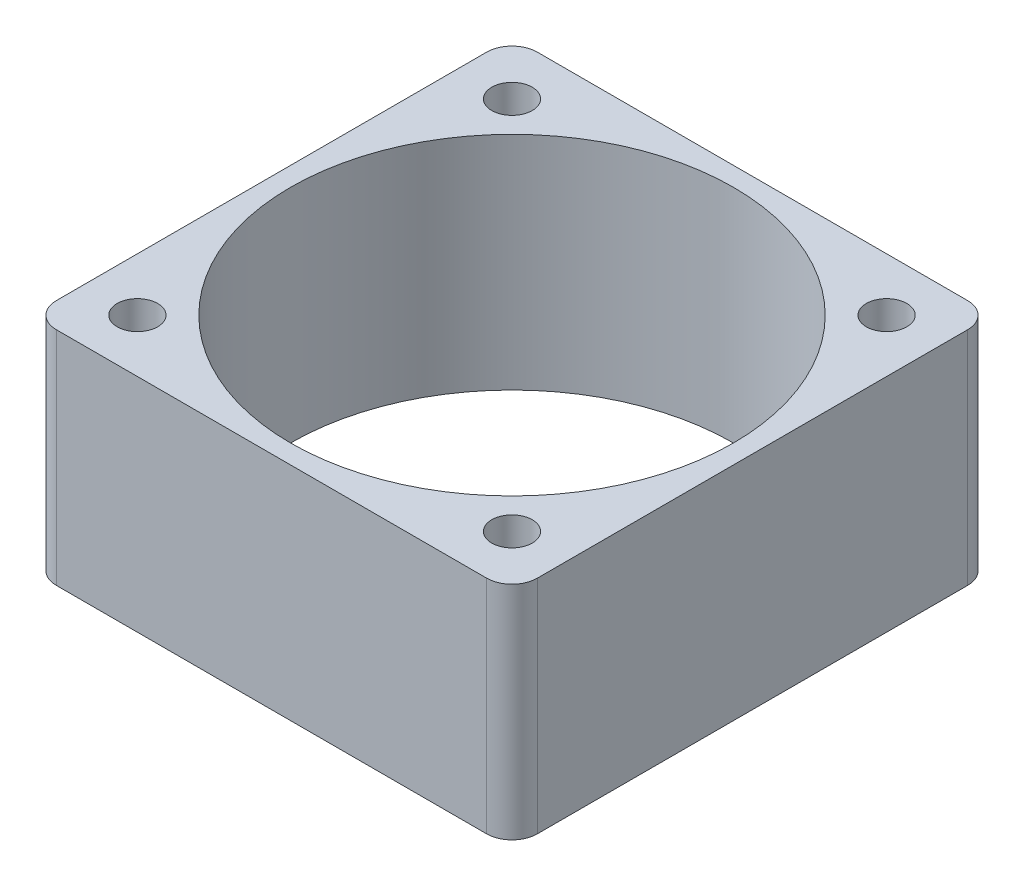
ISO-10303-21;
HEADER;
FILE_DESCRIPTION(('STEP AP214'),'2;1');
FILE_NAME('part.step','',(''),(''),'','','');
FILE_SCHEMA(('AUTOMOTIVE_DESIGN { 1 0 10303 214 1 1 1 1 }'));
ENDSEC;
DATA;
#1=APPLICATION_CONTEXT('core data for automotive mechanical design processes');
#2=APPLICATION_PROTOCOL_DEFINITION('international standard','automotive_design',2000,#1);
#3=PRODUCT_CONTEXT('',#1,'mechanical');
#4=PRODUCT('Part','Part','',(#3));
#5=PRODUCT_RELATED_PRODUCT_CATEGORY('part','',(#4));
#6=PRODUCT_DEFINITION_FORMATION('','',#4);
#7=PRODUCT_DEFINITION_CONTEXT('part definition',#1,'design');
#8=PRODUCT_DEFINITION('design','',#6,#7);
#9=PRODUCT_DEFINITION_SHAPE('','',#8);
#10=(LENGTH_UNIT() NAMED_UNIT(*) SI_UNIT(.MILLI.,.METRE.));
#11=(NAMED_UNIT(*) PLANE_ANGLE_UNIT() SI_UNIT($,.RADIAN.));
#12=(NAMED_UNIT(*) SI_UNIT($,.STERADIAN.) SOLID_ANGLE_UNIT());
#13=UNCERTAINTY_MEASURE_WITH_UNIT(LENGTH_MEASURE(1.E-05),#10,'distance_accuracy_value','');
#14=(GEOMETRIC_REPRESENTATION_CONTEXT(3) GLOBAL_UNCERTAINTY_ASSIGNED_CONTEXT((#13)) GLOBAL_UNIT_ASSIGNED_CONTEXT((#10,
#11,#12)) REPRESENTATION_CONTEXT('',''));
#15=CARTESIAN_POINT('',(0.,0.,0.));
#16=DIRECTION('',(0.,0.,1.));
#17=DIRECTION('',(1.,0.,0.));
#18=AXIS2_PLACEMENT_3D('',#15,#16,#17);
#19=CARTESIAN_POINT('',(-17.,17.5,17.));
#20=DIRECTION('',(0.,-1.,0.));
#21=DIRECTION('',(0.,0.,-1.));
#22=AXIS2_PLACEMENT_3D('',#19,#20,#21);
#23=CYLINDRICAL_SURFACE('',#22,2.);
#24=CARTESIAN_POINT('',(-17.,0.,17.));
#25=DIRECTION('',(0.,1.,0.));
#26=DIRECTION('',(0.,0.,1.));
#27=AXIS2_PLACEMENT_3D('',#24,#25,#26);
#28=CIRCLE('',#27,2.);
#29=CARTESIAN_POINT('',(-19.,0.,17.));
#30=VERTEX_POINT('',#29);
#31=CARTESIAN_POINT('',(-17.,0.,19.));
#32=VERTEX_POINT('',#31);
#33=EDGE_CURVE('E140',#30,#32,#28,.T.);
#34=ORIENTED_EDGE('',*,*,#33,.T.);
#35=DIRECTION('',(0.,-1.,0.));
#36=VECTOR('',#35,1.);
#37=CARTESIAN_POINT('',(-17.,17.5,19.));
#38=LINE('',#37,#36);
#39=CARTESIAN_POINT('',(-17.,17.5,19.));
#40=VERTEX_POINT('',#39);
#41=EDGE_CURVE('E11',#40,#32,#38,.T.);
#42=ORIENTED_EDGE('',*,*,#41,.F.);
#43=CARTESIAN_POINT('',(-17.,17.5,17.));
#44=DIRECTION('',(0.,1.,0.));
#45=DIRECTION('',(0.,0.,1.));
#46=AXIS2_PLACEMENT_3D('',#43,#44,#45);
#47=CIRCLE('',#46,2.);
#48=CARTESIAN_POINT('',(-19.,17.5,17.));
#49=VERTEX_POINT('',#48);
#50=EDGE_CURVE('E155',#49,#40,#47,.T.);
#51=ORIENTED_EDGE('',*,*,#50,.F.);
#52=DIRECTION('',(0.,-1.,0.));
#53=VECTOR('',#52,1.);
#54=CARTESIAN_POINT('',(-19.,17.5,17.));
#55=LINE('',#54,#53);
#56=EDGE_CURVE('E136',#49,#30,#55,.T.);
#57=ORIENTED_EDGE('',*,*,#56,.T.);
#58=EDGE_LOOP('',(#34,#42,#51,#57));
#59=FACE_BOUND('',#58,.T.);
#60=ADVANCED_FACE('F44',(#59),#23,.T.);
#61=CARTESIAN_POINT('',(17.,17.5,19.));
#62=DIRECTION('',(0.,0.,-1.));
#63=DIRECTION('',(-1.,0.,0.));
#64=AXIS2_PLACEMENT_3D('',#61,#62,#63);
#65=PLANE('',#64);
#66=DIRECTION('',(1.,0.,0.));
#67=VECTOR('',#66,1.);
#68=CARTESIAN_POINT('',(17.,0.,19.));
#69=LINE('',#68,#67);
#70=CARTESIAN_POINT('',(17.,0.,19.));
#71=VERTEX_POINT('',#70);
#72=EDGE_CURVE('E143',#32,#71,#69,.T.);
#73=ORIENTED_EDGE('',*,*,#72,.T.);
#74=DIRECTION('',(0.,-1.,0.));
#75=VECTOR('',#74,1.);
#76=CARTESIAN_POINT('',(17.,17.5,19.));
#77=LINE('',#76,#75);
#78=CARTESIAN_POINT('',(17.,17.5,19.));
#79=VERTEX_POINT('',#78);
#80=EDGE_CURVE('E52',#79,#71,#77,.T.);
#81=ORIENTED_EDGE('',*,*,#80,.F.);
#82=DIRECTION('',(1.,0.,0.));
#83=VECTOR('',#82,1.);
#84=CARTESIAN_POINT('',(17.,17.5,19.));
#85=LINE('',#84,#83);
#86=EDGE_CURVE('E103',#40,#79,#85,.T.);
#87=ORIENTED_EDGE('',*,*,#86,.F.);
#88=ORIENTED_EDGE('',*,*,#41,.T.);
#89=EDGE_LOOP('',(#73,#81,#87,#88));
#90=FACE_BOUND('',#89,.T.);
#91=ADVANCED_FACE('F233',(#90),#65,.F.);
#92=CARTESIAN_POINT('',(17.,17.5,17.));
#93=DIRECTION('',(0.,-1.,0.));
#94=DIRECTION('',(0.,0.,-1.));
#95=AXIS2_PLACEMENT_3D('',#92,#93,#94);
#96=CYLINDRICAL_SURFACE('',#95,2.);
#97=CARTESIAN_POINT('',(17.,0.,17.));
#98=DIRECTION('',(0.,1.,0.));
#99=DIRECTION('',(0.,0.,1.));
#100=AXIS2_PLACEMENT_3D('',#97,#98,#99);
#101=CIRCLE('',#100,2.);
#102=CARTESIAN_POINT('',(19.,0.,17.));
#103=VERTEX_POINT('',#102);
#104=EDGE_CURVE('E146',#71,#103,#101,.T.);
#105=ORIENTED_EDGE('',*,*,#104,.T.);
#106=DIRECTION('',(0.,-1.,0.));
#107=VECTOR('',#106,1.);
#108=CARTESIAN_POINT('',(19.,17.5,17.));
#109=LINE('',#108,#107);
#110=CARTESIAN_POINT('',(19.,17.5,17.));
#111=VERTEX_POINT('',#110);
#112=EDGE_CURVE('E162',#111,#103,#109,.T.);
#113=ORIENTED_EDGE('',*,*,#112,.F.);
#114=CARTESIAN_POINT('',(17.,17.5,17.));
#115=DIRECTION('',(0.,1.,0.));
#116=DIRECTION('',(0.,0.,1.));
#117=AXIS2_PLACEMENT_3D('',#114,#115,#116);
#118=CIRCLE('',#117,2.);
#119=EDGE_CURVE('E170',#79,#111,#118,.T.);
#120=ORIENTED_EDGE('',*,*,#119,.F.);
#121=ORIENTED_EDGE('',*,*,#80,.T.);
#122=EDGE_LOOP('',(#105,#113,#120,#121));
#123=FACE_BOUND('',#122,.T.);
#124=ADVANCED_FACE('F168',(#123),#96,.T.);
#125=CARTESIAN_POINT('',(19.,17.5,17.));
#126=DIRECTION('',(-1.,0.,0.));
#127=DIRECTION('',(0.,0.,1.));
#128=AXIS2_PLACEMENT_3D('',#125,#126,#127);
#129=PLANE('',#128);
#130=DIRECTION('',(0.,0.,-1.));
#131=VECTOR('',#130,1.);
#132=CARTESIAN_POINT('',(19.,0.,17.));
#133=LINE('',#132,#131);
#134=CARTESIAN_POINT('',(19.,0.,-17.));
#135=VERTEX_POINT('',#134);
#136=EDGE_CURVE('E148',#103,#135,#133,.T.);
#137=ORIENTED_EDGE('',*,*,#136,.T.);
#138=DIRECTION('',(0.,-1.,0.));
#139=VECTOR('',#138,1.);
#140=CARTESIAN_POINT('',(19.,17.5,-17.));
#141=LINE('',#140,#139);
#142=CARTESIAN_POINT('',(19.,17.5,-17.));
#143=VERTEX_POINT('',#142);
#144=EDGE_CURVE('E159',#143,#135,#141,.T.);
#145=ORIENTED_EDGE('',*,*,#144,.F.);
#146=DIRECTION('',(0.,0.,-1.));
#147=VECTOR('',#146,1.);
#148=CARTESIAN_POINT('',(19.,17.5,17.));
#149=LINE('',#148,#147);
#150=EDGE_CURVE('E182',#111,#143,#149,.T.);
#151=ORIENTED_EDGE('',*,*,#150,.F.);
#152=ORIENTED_EDGE('',*,*,#112,.T.);
#153=EDGE_LOOP('',(#137,#145,#151,#152));
#154=FACE_BOUND('',#153,.T.);
#155=ADVANCED_FACE('F178',(#154),#129,.F.);
#156=CARTESIAN_POINT('',(17.,17.5,-17.));
#157=DIRECTION('',(0.,-1.,0.));
#158=DIRECTION('',(0.,0.,-1.));
#159=AXIS2_PLACEMENT_3D('',#156,#157,#158);
#160=CYLINDRICAL_SURFACE('',#159,2.);
#161=CARTESIAN_POINT('',(17.,0.,-17.));
#162=DIRECTION('',(0.,1.,0.));
#163=DIRECTION('',(0.,0.,-1.));
#164=AXIS2_PLACEMENT_3D('',#161,#162,#163);
#165=CIRCLE('',#164,2.);
#166=CARTESIAN_POINT('',(17.,0.,-19.));
#167=VERTEX_POINT('',#166);
#168=EDGE_CURVE('E150',#135,#167,#165,.T.);
#169=ORIENTED_EDGE('',*,*,#168,.T.);
#170=DIRECTION('',(0.,-1.,0.));
#171=VECTOR('',#170,1.);
#172=CARTESIAN_POINT('',(17.,17.5,-19.));
#173=LINE('',#172,#171);
#174=CARTESIAN_POINT('',(17.,17.5,-19.));
#175=VERTEX_POINT('',#174);
#176=EDGE_CURVE('E131',#175,#167,#173,.T.);
#177=ORIENTED_EDGE('',*,*,#176,.F.);
#178=CARTESIAN_POINT('',(17.,17.5,-17.));
#179=DIRECTION('',(0.,1.,0.));
#180=DIRECTION('',(0.,0.,-1.));
#181=AXIS2_PLACEMENT_3D('',#178,#179,#180);
#182=CIRCLE('',#181,2.);
#183=EDGE_CURVE('E122',#143,#175,#182,.T.);
#184=ORIENTED_EDGE('',*,*,#183,.F.);
#185=ORIENTED_EDGE('',*,*,#144,.T.);
#186=EDGE_LOOP('',(#169,#177,#184,#185));
#187=FACE_BOUND('',#186,.T.);
#188=ADVANCED_FACE('F181',(#187),#160,.T.);
#189=CARTESIAN_POINT('',(17.,17.5,-19.));
#190=DIRECTION('',(0.,0.,1.));
#191=DIRECTION('',(1.,0.,0.));
#192=AXIS2_PLACEMENT_3D('',#189,#190,#191);
#193=PLANE('',#192);
#194=DIRECTION('',(-1.,0.,0.));
#195=VECTOR('',#194,1.);
#196=CARTESIAN_POINT('',(17.,0.,-19.));
#197=LINE('',#196,#195);
#198=CARTESIAN_POINT('',(-17.,0.,-19.));
#199=VERTEX_POINT('',#198);
#200=EDGE_CURVE('E130',#167,#199,#197,.T.);
#201=ORIENTED_EDGE('',*,*,#200,.T.);
#202=DIRECTION('',(0.,-1.,0.));
#203=VECTOR('',#202,1.);
#204=CARTESIAN_POINT('',(-17.,17.5,-19.));
#205=LINE('',#204,#203);
#206=CARTESIAN_POINT('',(-17.,17.5,-19.));
#207=VERTEX_POINT('',#206);
#208=EDGE_CURVE('E127',#207,#199,#205,.T.);
#209=ORIENTED_EDGE('',*,*,#208,.F.);
#210=DIRECTION('',(-1.,0.,0.));
#211=VECTOR('',#210,1.);
#212=CARTESIAN_POINT('',(17.,17.5,-19.));
#213=LINE('',#212,#211);
#214=EDGE_CURVE('E116',#175,#207,#213,.T.);
#215=ORIENTED_EDGE('',*,*,#214,.F.);
#216=ORIENTED_EDGE('',*,*,#176,.T.);
#217=EDGE_LOOP('',(#201,#209,#215,#216));
#218=FACE_BOUND('',#217,.T.);
#219=ADVANCED_FACE('F128',(#218),#193,.F.);
#220=CARTESIAN_POINT('',(-17.,17.5,-17.));
#221=DIRECTION('',(0.,-1.,0.));
#222=DIRECTION('',(0.,0.,-1.));
#223=AXIS2_PLACEMENT_3D('',#220,#221,#222);
#224=CYLINDRICAL_SURFACE('',#223,2.);
#225=CARTESIAN_POINT('',(-17.,0.,-17.));
#226=DIRECTION('',(0.,1.,0.));
#227=DIRECTION('',(0.,0.,1.));
#228=AXIS2_PLACEMENT_3D('',#225,#226,#227);
#229=CIRCLE('',#228,2.);
#230=CARTESIAN_POINT('',(-19.,0.,-17.));
#231=VERTEX_POINT('',#230);
#232=EDGE_CURVE('E89',#199,#231,#229,.T.);
#233=ORIENTED_EDGE('',*,*,#232,.T.);
#234=DIRECTION('',(0.,-1.,0.));
#235=VECTOR('',#234,1.);
#236=CARTESIAN_POINT('',(-19.,17.5,-17.));
#237=LINE('',#236,#235);
#238=CARTESIAN_POINT('',(-19.,17.5,-17.));
#239=VERTEX_POINT('',#238);
#240=EDGE_CURVE('E132',#239,#231,#237,.T.);
#241=ORIENTED_EDGE('',*,*,#240,.F.);
#242=CARTESIAN_POINT('',(-17.,17.5,-17.));
#243=DIRECTION('',(0.,1.,0.));
#244=DIRECTION('',(0.,0.,1.));
#245=AXIS2_PLACEMENT_3D('',#242,#243,#244);
#246=CIRCLE('',#245,2.);
#247=EDGE_CURVE('E120',#207,#239,#246,.T.);
#248=ORIENTED_EDGE('',*,*,#247,.F.);
#249=ORIENTED_EDGE('',*,*,#208,.T.);
#250=EDGE_LOOP('',(#233,#241,#248,#249));
#251=FACE_BOUND('',#250,.T.);
#252=ADVANCED_FACE('F134',(#251),#224,.T.);
#253=CARTESIAN_POINT('',(-19.,17.5,17.));
#254=DIRECTION('',(1.,0.,0.));
#255=DIRECTION('',(0.,0.,-1.));
#256=AXIS2_PLACEMENT_3D('',#253,#254,#255);
#257=PLANE('',#256);
#258=DIRECTION('',(0.,0.,1.));
#259=VECTOR('',#258,1.);
#260=CARTESIAN_POINT('',(-19.,0.,17.));
#261=LINE('',#260,#259);
#262=EDGE_CURVE('E95',#231,#30,#261,.T.);
#263=ORIENTED_EDGE('',*,*,#262,.T.);
#264=ORIENTED_EDGE('',*,*,#56,.F.);
#265=DIRECTION('',(0.,0.,1.));
#266=VECTOR('',#265,1.);
#267=CARTESIAN_POINT('',(-19.,17.5,17.));
#268=LINE('',#267,#266);
#269=EDGE_CURVE('E60',#239,#49,#268,.T.);
#270=ORIENTED_EDGE('',*,*,#269,.F.);
#271=ORIENTED_EDGE('',*,*,#240,.T.);
#272=EDGE_LOOP('',(#263,#264,#270,#271));
#273=FACE_BOUND('',#272,.T.);
#274=ADVANCED_FACE('F241',(#273),#257,.F.);
#275=CARTESIAN_POINT('',(-17.,17.5,17.));
#276=DIRECTION('',(0.,1.,0.));
#277=DIRECTION('',(0.,0.,1.));
#278=AXIS2_PLACEMENT_3D('',#275,#276,#277);
#279=PLANE('',#278);
#280=CARTESIAN_POINT('',(0.,17.5,0.));
#281=DIRECTION('',(0.,1.,0.));
#282=DIRECTION('',(0.,0.,1.));
#283=AXIS2_PLACEMENT_3D('',#280,#281,#282);
#284=CIRCLE('',#283,17.5);
#285=CARTESIAN_POINT('',(0.,17.5,17.5));
#286=VERTEX_POINT('',#285);
#287=EDGE_CURVE('E204',#286,#286,#284,.T.);
#288=ORIENTED_EDGE('',*,*,#287,.F.);
#289=EDGE_LOOP('',(#288));
#290=FACE_BOUND('',#289,.T.);
#291=CARTESIAN_POINT('',(-14.8,17.5,14.8));
#292=DIRECTION('',(0.,1.,0.));
#293=DIRECTION('',(0.,0.,1.));
#294=AXIS2_PLACEMENT_3D('',#291,#292,#293);
#295=CIRCLE('',#294,1.6);
#296=CARTESIAN_POINT('',(-14.8,17.5,16.4));
#297=VERTEX_POINT('',#296);
#298=EDGE_CURVE('E144',#297,#297,#295,.T.);
#299=ORIENTED_EDGE('',*,*,#298,.F.);
#300=EDGE_LOOP('',(#299));
#301=FACE_BOUND('',#300,.T.);
#302=CARTESIAN_POINT('',(14.8,17.5,14.8));
#303=DIRECTION('',(0.,1.,0.));
#304=DIRECTION('',(0.,0.,1.));
#305=AXIS2_PLACEMENT_3D('',#302,#303,#304);
#306=CIRCLE('',#305,1.6);
#307=CARTESIAN_POINT('',(14.8,17.5,16.4));
#308=VERTEX_POINT('',#307);
#309=EDGE_CURVE('E190',#308,#308,#306,.T.);
#310=ORIENTED_EDGE('',*,*,#309,.F.);
#311=EDGE_LOOP('',(#310));
#312=FACE_BOUND('',#311,.T.);
#313=CARTESIAN_POINT('',(14.8,17.5,-14.8));
#314=DIRECTION('',(0.,1.,0.));
#315=DIRECTION('',(0.,0.,1.));
#316=AXIS2_PLACEMENT_3D('',#313,#314,#315);
#317=CIRCLE('',#316,1.6);
#318=CARTESIAN_POINT('',(14.8,17.5,-13.2));
#319=VERTEX_POINT('',#318);
#320=EDGE_CURVE('E193',#319,#319,#317,.T.);
#321=ORIENTED_EDGE('',*,*,#320,.F.);
#322=EDGE_LOOP('',(#321));
#323=FACE_BOUND('',#322,.T.);
#324=CARTESIAN_POINT('',(-14.8,17.5,-14.8));
#325=DIRECTION('',(0.,1.,0.));
#326=DIRECTION('',(0.,0.,1.));
#327=AXIS2_PLACEMENT_3D('',#324,#325,#326);
#328=CIRCLE('',#327,1.6);
#329=CARTESIAN_POINT('',(-14.8,17.5,-13.2));
#330=VERTEX_POINT('',#329);
#331=EDGE_CURVE('E196',#330,#330,#328,.T.);
#332=ORIENTED_EDGE('',*,*,#331,.F.);
#333=EDGE_LOOP('',(#332));
#334=FACE_BOUND('',#333,.T.);
#335=ORIENTED_EDGE('',*,*,#50,.T.);
#336=ORIENTED_EDGE('',*,*,#86,.T.);
#337=ORIENTED_EDGE('',*,*,#119,.T.);
#338=ORIENTED_EDGE('',*,*,#150,.T.);
#339=ORIENTED_EDGE('',*,*,#183,.T.);
#340=ORIENTED_EDGE('',*,*,#214,.T.);
#341=ORIENTED_EDGE('',*,*,#247,.T.);
#342=ORIENTED_EDGE('',*,*,#269,.T.);
#343=EDGE_LOOP('',(#335,#336,#337,#338,#339,#340,#341,#342));
#344=FACE_BOUND('',#343,.T.);
#345=ADVANCED_FACE('F118',(#290,#301,#312,#323,#334,#344),#279,.T.);
#346=CARTESIAN_POINT('',(-17.,0.,17.));
#347=DIRECTION('',(0.,1.,0.));
#348=DIRECTION('',(0.,0.,1.));
#349=AXIS2_PLACEMENT_3D('',#346,#347,#348);
#350=PLANE('',#349);
#351=CARTESIAN_POINT('',(0.,0.,0.));
#352=DIRECTION('',(0.,1.,0.));
#353=DIRECTION('',(0.,0.,1.));
#354=AXIS2_PLACEMENT_3D('',#351,#352,#353);
#355=CIRCLE('',#354,17.5);
#356=CARTESIAN_POINT('',(0.,0.,17.5));
#357=VERTEX_POINT('',#356);
#358=EDGE_CURVE('E214',#357,#357,#355,.T.);
#359=ORIENTED_EDGE('',*,*,#358,.T.);
#360=EDGE_LOOP('',(#359));
#361=FACE_BOUND('',#360,.T.);
#362=CARTESIAN_POINT('',(-14.8,0.,14.8));
#363=DIRECTION('',(0.,-1.,0.));
#364=DIRECTION('',(0.,0.,-1.));
#365=AXIS2_PLACEMENT_3D('',#362,#363,#364);
#366=CIRCLE('',#365,1.6);
#367=CARTESIAN_POINT('',(-14.8,0.,13.2));
#368=VERTEX_POINT('',#367);
#369=EDGE_CURVE('E199',#368,#368,#366,.T.);
#370=ORIENTED_EDGE('',*,*,#369,.F.);
#371=EDGE_LOOP('',(#370));
#372=FACE_BOUND('',#371,.T.);
#373=CARTESIAN_POINT('',(14.8,0.,14.8));
#374=DIRECTION('',(0.,-1.,0.));
#375=DIRECTION('',(0.,0.,-1.));
#376=AXIS2_PLACEMENT_3D('',#373,#374,#375);
#377=CIRCLE('',#376,1.6);
#378=CARTESIAN_POINT('',(14.8,0.,13.2));
#379=VERTEX_POINT('',#378);
#380=EDGE_CURVE('E207',#379,#379,#377,.T.);
#381=ORIENTED_EDGE('',*,*,#380,.F.);
#382=EDGE_LOOP('',(#381));
#383=FACE_BOUND('',#382,.T.);
#384=CARTESIAN_POINT('',(14.8,0.,-14.8));
#385=DIRECTION('',(0.,-1.,0.));
#386=DIRECTION('',(0.,0.,-1.));
#387=AXIS2_PLACEMENT_3D('',#384,#385,#386);
#388=CIRCLE('',#387,1.6);
#389=CARTESIAN_POINT('',(14.8,0.,-16.4));
#390=VERTEX_POINT('',#389);
#391=EDGE_CURVE('E203',#390,#390,#388,.T.);
#392=ORIENTED_EDGE('',*,*,#391,.F.);
#393=EDGE_LOOP('',(#392));
#394=FACE_BOUND('',#393,.T.);
#395=CARTESIAN_POINT('',(-14.8,0.,-14.8));
#396=DIRECTION('',(0.,-1.,0.));
#397=DIRECTION('',(0.,0.,-1.));
#398=AXIS2_PLACEMENT_3D('',#395,#396,#397);
#399=CIRCLE('',#398,1.6);
#400=CARTESIAN_POINT('',(-14.8,0.,-16.4));
#401=VERTEX_POINT('',#400);
#402=EDGE_CURVE('E200',#401,#401,#399,.T.);
#403=ORIENTED_EDGE('',*,*,#402,.F.);
#404=EDGE_LOOP('',(#403));
#405=FACE_BOUND('',#404,.T.);
#406=ORIENTED_EDGE('',*,*,#33,.F.);
#407=ORIENTED_EDGE('',*,*,#262,.F.);
#408=ORIENTED_EDGE('',*,*,#232,.F.);
#409=ORIENTED_EDGE('',*,*,#200,.F.);
#410=ORIENTED_EDGE('',*,*,#168,.F.);
#411=ORIENTED_EDGE('',*,*,#136,.F.);
#412=ORIENTED_EDGE('',*,*,#104,.F.);
#413=ORIENTED_EDGE('',*,*,#72,.F.);
#414=EDGE_LOOP('',(#406,#407,#408,#409,#410,#411,#412,#413));
#415=FACE_BOUND('',#414,.T.);
#416=ADVANCED_FACE('F174',(#361,#372,#383,#394,#405,#415),#350,.F.);
#417=CARTESIAN_POINT('',(-14.8,88.5,-14.8));
#418=DIRECTION('',(0.,-1.,0.));
#419=DIRECTION('',(0.,0.,-1.));
#420=AXIS2_PLACEMENT_3D('',#417,#418,#419);
#421=CYLINDRICAL_SURFACE('',#420,1.6);
#422=ORIENTED_EDGE('',*,*,#331,.T.);
#423=EDGE_LOOP('',(#422));
#424=FACE_BOUND('',#423,.T.);
#425=ORIENTED_EDGE('',*,*,#402,.T.);
#426=EDGE_LOOP('',(#425));
#427=FACE_BOUND('',#426,.T.);
#428=ADVANCED_FACE('F293',(#424,#427),#421,.F.);
#429=CARTESIAN_POINT('',(14.8,88.5,-14.8));
#430=DIRECTION('',(0.,-1.,0.));
#431=DIRECTION('',(0.,0.,-1.));
#432=AXIS2_PLACEMENT_3D('',#429,#430,#431);
#433=CYLINDRICAL_SURFACE('',#432,1.6);
#434=ORIENTED_EDGE('',*,*,#320,.T.);
#435=EDGE_LOOP('',(#434));
#436=FACE_BOUND('',#435,.T.);
#437=ORIENTED_EDGE('',*,*,#391,.T.);
#438=EDGE_LOOP('',(#437));
#439=FACE_BOUND('',#438,.T.);
#440=ADVANCED_FACE('F297',(#436,#439),#433,.F.);
#441=CARTESIAN_POINT('',(14.8,88.5,14.8));
#442=DIRECTION('',(0.,-1.,0.));
#443=DIRECTION('',(0.,0.,-1.));
#444=AXIS2_PLACEMENT_3D('',#441,#442,#443);
#445=CYLINDRICAL_SURFACE('',#444,1.6);
#446=ORIENTED_EDGE('',*,*,#309,.T.);
#447=EDGE_LOOP('',(#446));
#448=FACE_BOUND('',#447,.T.);
#449=ORIENTED_EDGE('',*,*,#380,.T.);
#450=EDGE_LOOP('',(#449));
#451=FACE_BOUND('',#450,.T.);
#452=ADVANCED_FACE('F229',(#448,#451),#445,.F.);
#453=CARTESIAN_POINT('',(-14.8,88.5,14.8));
#454=DIRECTION('',(0.,-1.,0.));
#455=DIRECTION('',(0.,0.,-1.));
#456=AXIS2_PLACEMENT_3D('',#453,#454,#455);
#457=CYLINDRICAL_SURFACE('',#456,1.6);
#458=ORIENTED_EDGE('',*,*,#298,.T.);
#459=EDGE_LOOP('',(#458));
#460=FACE_BOUND('',#459,.T.);
#461=ORIENTED_EDGE('',*,*,#369,.T.);
#462=EDGE_LOOP('',(#461));
#463=FACE_BOUND('',#462,.T.);
#464=ADVANCED_FACE('F222',(#460,#463),#457,.F.);
#465=CARTESIAN_POINT('',(0.,0.,0.));
#466=DIRECTION('',(0.,1.,0.));
#467=DIRECTION('',(0.,0.,1.));
#468=AXIS2_PLACEMENT_3D('',#465,#466,#467);
#469=CYLINDRICAL_SURFACE('',#468,17.5);
#470=ORIENTED_EDGE('',*,*,#287,.T.);
#471=EDGE_LOOP('',(#470));
#472=FACE_BOUND('',#471,.T.);
#473=ORIENTED_EDGE('',*,*,#358,.F.);
#474=EDGE_LOOP('',(#473));
#475=FACE_BOUND('',#474,.T.);
#476=ADVANCED_FACE('F220',(#472,#475),#469,.F.);
#477=CLOSED_SHELL('',(#60,#91,#124,#155,#188,#219,#252,#274,#345,#416,#428,#440,#452,#464,#476));
#478=MANIFOLD_SOLID_BREP('B2',#477);
#479=ADVANCED_BREP_SHAPE_REPRESENTATION('',(#18,#478),#14);
#480=SHAPE_DEFINITION_REPRESENTATION(#9,#479);
ENDSEC;
END-ISO-10303-21;
